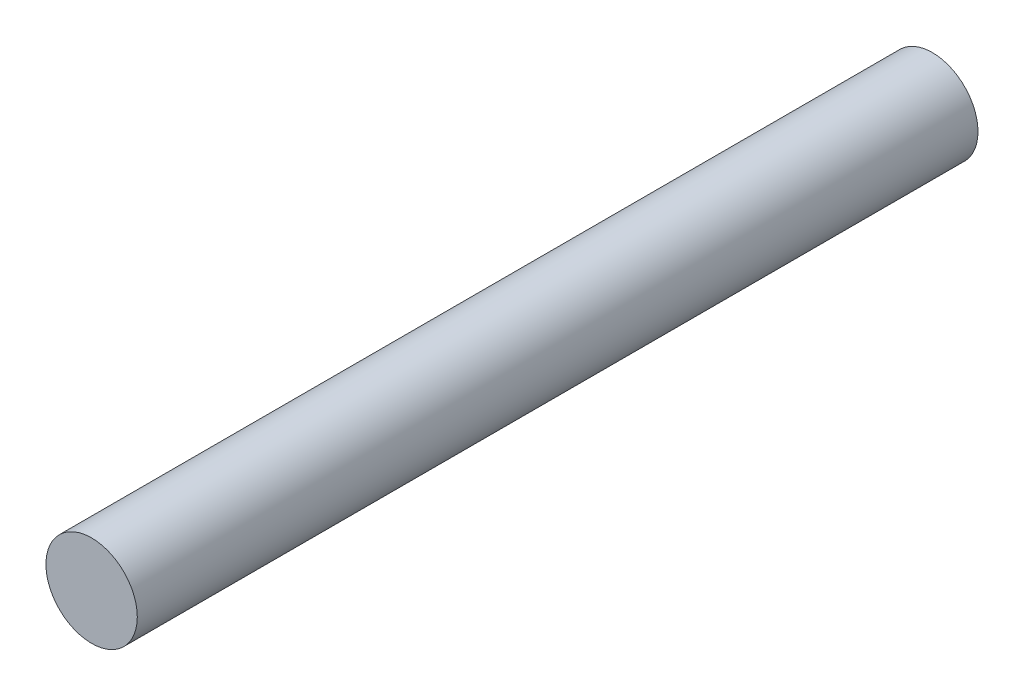
ISO-10303-21;
HEADER;
FILE_DESCRIPTION(('STEP AP214'),'2;1');
FILE_NAME('part.step','',(''),(''),'','','');
FILE_SCHEMA(('AUTOMOTIVE_DESIGN { 1 0 10303 214 1 1 1 1 }'));
ENDSEC;
DATA;
#1=APPLICATION_CONTEXT('core data for automotive mechanical design processes');
#2=APPLICATION_PROTOCOL_DEFINITION('international standard','automotive_design',2000,#1);
#3=PRODUCT_CONTEXT('',#1,'mechanical');
#4=PRODUCT('Part','Part','',(#3));
#5=PRODUCT_RELATED_PRODUCT_CATEGORY('part','',(#4));
#6=PRODUCT_DEFINITION_FORMATION('','',#4);
#7=PRODUCT_DEFINITION_CONTEXT('part definition',#1,'design');
#8=PRODUCT_DEFINITION('design','',#6,#7);
#9=PRODUCT_DEFINITION_SHAPE('','',#8);
#10=(LENGTH_UNIT() NAMED_UNIT(*) SI_UNIT(.MILLI.,.METRE.));
#11=(NAMED_UNIT(*) PLANE_ANGLE_UNIT() SI_UNIT($,.RADIAN.));
#12=(NAMED_UNIT(*) SI_UNIT($,.STERADIAN.) SOLID_ANGLE_UNIT());
#13=UNCERTAINTY_MEASURE_WITH_UNIT(LENGTH_MEASURE(1.E-05),#10,'distance_accuracy_value','');
#14=(GEOMETRIC_REPRESENTATION_CONTEXT(3) GLOBAL_UNCERTAINTY_ASSIGNED_CONTEXT((#13)) GLOBAL_UNIT_ASSIGNED_CONTEXT((#10,
#11,#12)) REPRESENTATION_CONTEXT('',''));
#15=CARTESIAN_POINT('',(0.,0.,0.));
#16=DIRECTION('',(0.,0.,1.));
#17=DIRECTION('',(1.,0.,0.));
#18=AXIS2_PLACEMENT_3D('',#15,#16,#17);
#19=CARTESIAN_POINT('',(0.,0.,46.));
#20=DIRECTION('',(0.,0.,-1.));
#21=DIRECTION('',(-1.,0.,0.));
#22=AXIS2_PLACEMENT_3D('',#19,#20,#21);
#23=CYLINDRICAL_SURFACE('',#22,2.5);
#24=CARTESIAN_POINT('',(0.,0.,46.));
#25=DIRECTION('',(0.,0.,1.));
#26=DIRECTION('',(1.,0.,0.));
#27=AXIS2_PLACEMENT_3D('',#24,#25,#26);
#28=CIRCLE('',#27,2.5);
#29=CARTESIAN_POINT('',(2.5,0.,46.));
#30=VERTEX_POINT('',#29);
#31=EDGE_CURVE('E10',#30,#30,#28,.T.);
#32=ORIENTED_EDGE('',*,*,#31,.F.);
#33=EDGE_LOOP('',(#32));
#34=FACE_BOUND('',#33,.T.);
#35=CARTESIAN_POINT('',(0.,0.,0.));
#36=DIRECTION('',(0.,0.,1.));
#37=DIRECTION('',(1.,0.,0.));
#38=AXIS2_PLACEMENT_3D('',#35,#36,#37);
#39=CIRCLE('',#38,2.5);
#40=CARTESIAN_POINT('',(2.5,0.,0.));
#41=VERTEX_POINT('',#40);
#42=EDGE_CURVE('E38',#41,#41,#39,.T.);
#43=ORIENTED_EDGE('',*,*,#42,.T.);
#44=EDGE_LOOP('',(#43));
#45=FACE_BOUND('',#44,.T.);
#46=ADVANCED_FACE('F35',(#34,#45),#23,.T.);
#47=CARTESIAN_POINT('',(0.,0.,46.));
#48=DIRECTION('',(0.,0.,1.));
#49=DIRECTION('',(1.,0.,0.));
#50=AXIS2_PLACEMENT_3D('',#47,#48,#49);
#51=PLANE('',#50);
#52=ORIENTED_EDGE('',*,*,#31,.T.);
#53=EDGE_LOOP('',(#52));
#54=FACE_BOUND('',#53,.T.);
#55=ADVANCED_FACE('F56',(#54),#51,.T.);
#56=CARTESIAN_POINT('',(0.,0.,0.));
#57=DIRECTION('',(0.,0.,1.));
#58=DIRECTION('',(1.,0.,0.));
#59=AXIS2_PLACEMENT_3D('',#56,#57,#58);
#60=PLANE('',#59);
#61=ORIENTED_EDGE('',*,*,#42,.F.);
#62=EDGE_LOOP('',(#61));
#63=FACE_BOUND('',#62,.T.);
#64=ADVANCED_FACE('F54',(#63),#60,.F.);
#65=CLOSED_SHELL('',(#46,#55,#64));
#66=MANIFOLD_SOLID_BREP('B2',#65);
#67=ADVANCED_BREP_SHAPE_REPRESENTATION('',(#18,#66),#14);
#68=SHAPE_DEFINITION_REPRESENTATION(#9,#67);
ENDSEC;
END-ISO-10303-21;
